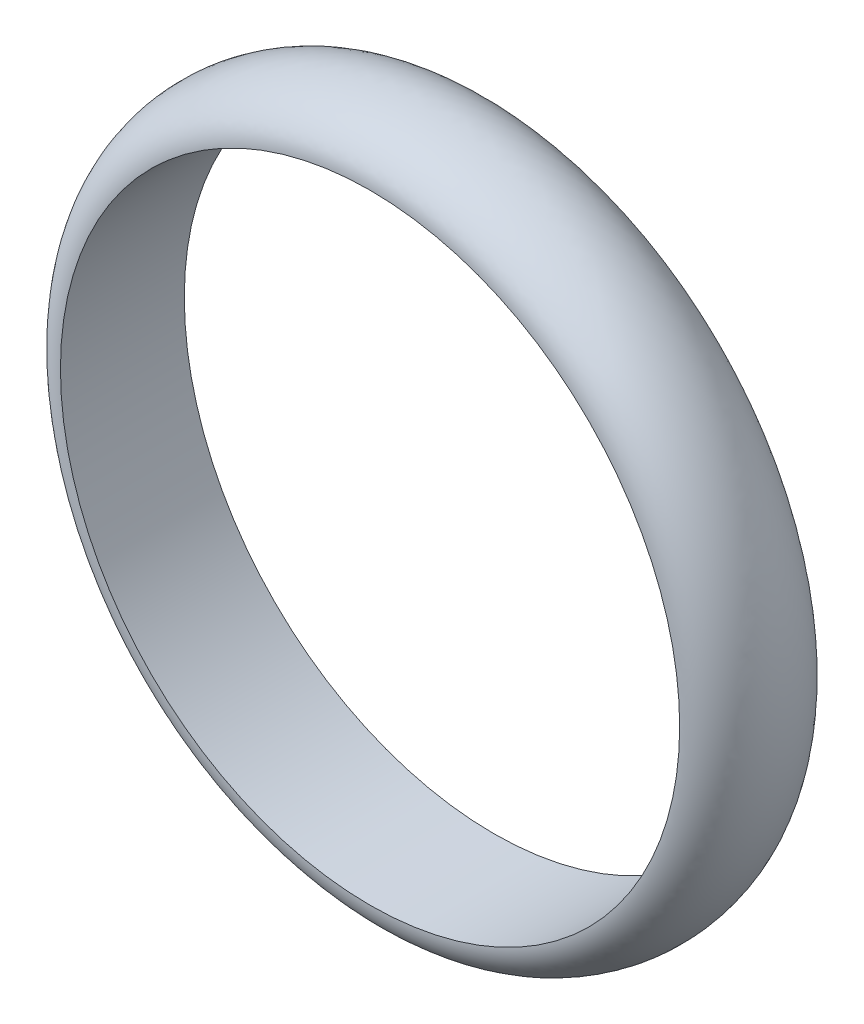
ISO-10303-21;
HEADER;
FILE_DESCRIPTION(('STEP AP214'),'2;1');
FILE_NAME('part.step','',(''),(''),'','','');
FILE_SCHEMA(('AUTOMOTIVE_DESIGN { 1 0 10303 214 1 1 1 1 }'));
ENDSEC;
DATA;
#1=APPLICATION_CONTEXT('core data for automotive mechanical design processes');
#2=APPLICATION_PROTOCOL_DEFINITION('international standard','automotive_design',2000,#1);
#3=PRODUCT_CONTEXT('',#1,'mechanical');
#4=PRODUCT('Part','Part','',(#3));
#5=PRODUCT_RELATED_PRODUCT_CATEGORY('part','',(#4));
#6=PRODUCT_DEFINITION_FORMATION('','',#4);
#7=PRODUCT_DEFINITION_CONTEXT('part definition',#1,'design');
#8=PRODUCT_DEFINITION('design','',#6,#7);
#9=PRODUCT_DEFINITION_SHAPE('','',#8);
#10=(LENGTH_UNIT() NAMED_UNIT(*) SI_UNIT(.MILLI.,.METRE.));
#11=(NAMED_UNIT(*) PLANE_ANGLE_UNIT() SI_UNIT($,.RADIAN.));
#12=(NAMED_UNIT(*) SI_UNIT($,.STERADIAN.) SOLID_ANGLE_UNIT());
#13=UNCERTAINTY_MEASURE_WITH_UNIT(LENGTH_MEASURE(1.E-05),#10,'distance_accuracy_value','');
#14=(GEOMETRIC_REPRESENTATION_CONTEXT(3) GLOBAL_UNCERTAINTY_ASSIGNED_CONTEXT((#13)) GLOBAL_UNIT_ASSIGNED_CONTEXT((#10,
#11,#12)) REPRESENTATION_CONTEXT('',''));
#15=CARTESIAN_POINT('',(0.,0.,0.));
#16=DIRECTION('',(0.,0.,1.));
#17=DIRECTION('',(1.,0.,0.));
#18=AXIS2_PLACEMENT_3D('',#15,#16,#17);
#19=CARTESIAN_POINT('',(0.,0.,0.));
#20=DIRECTION('',(0.,0.,1.));
#21=DIRECTION('',(1.,0.,0.));
#22=AXIS2_PLACEMENT_3D('',#19,#20,#21);
#23=CYLINDRICAL_SURFACE('',#22,50.);
#24=CARTESIAN_POINT('',(0.,0.,-9.99999999999999));
#25=DIRECTION('',(0.,0.,1.));
#26=DIRECTION('',(1.,0.,0.));
#27=AXIS2_PLACEMENT_3D('',#24,#25,#26);
#28=CIRCLE('',#27,50.);
#29=CARTESIAN_POINT('',(50.,0.,-9.99999999999999));
#30=VERTEX_POINT('',#29);
#31=EDGE_CURVE('E37',#30,#30,#28,.T.);
#32=ORIENTED_EDGE('',*,*,#31,.F.);
#33=EDGE_LOOP('',(#32));
#34=FACE_BOUND('',#33,.T.);
#35=CARTESIAN_POINT('',(0.,0.,10.));
#36=DIRECTION('',(0.,0.,1.));
#37=DIRECTION('',(1.,0.,0.));
#38=AXIS2_PLACEMENT_3D('',#35,#36,#37);
#39=CIRCLE('',#38,50.);
#40=CARTESIAN_POINT('',(50.,0.,10.));
#41=VERTEX_POINT('',#40);
#42=EDGE_CURVE('E10',#41,#41,#39,.T.);
#43=ORIENTED_EDGE('',*,*,#42,.T.);
#44=EDGE_LOOP('',(#43));
#45=FACE_BOUND('',#44,.T.);
#46=ADVANCED_FACE('F31',(#34,#45),#23,.F.);
#47=CARTESIAN_POINT('',(0.,50.,0.));
#48=DIRECTION('',(-1.,0.,0.));
#49=DIRECTION('',(0.,0.,1.));
#50=AXIS2_PLACEMENT_3D('',#47,#48,#49);
#51=ELLIPSE('',#50,10.,7.);
#52=CARTESIAN_POINT('',(0.,0.,0.));
#53=DIRECTION('',(0.,0.,1.));
#54=AXIS1_PLACEMENT('',#52,#53);
#55=SURFACE_OF_REVOLUTION('',#51,#54);
#56=ORIENTED_EDGE('',*,*,#31,.T.);
#57=EDGE_LOOP('',(#56));
#58=FACE_BOUND('',#57,.T.);
#59=ORIENTED_EDGE('',*,*,#42,.F.);
#60=EDGE_LOOP('',(#59));
#61=FACE_BOUND('',#60,.T.);
#62=ADVANCED_FACE('F45',(#58,#61),#55,.F.);
#63=CLOSED_SHELL('',(#46,#62));
#64=MANIFOLD_SOLID_BREP('B2',#63);
#65=ADVANCED_BREP_SHAPE_REPRESENTATION('',(#18,#64),#14);
#66=SHAPE_DEFINITION_REPRESENTATION(#9,#65);
ENDSEC;
END-ISO-10303-21;
